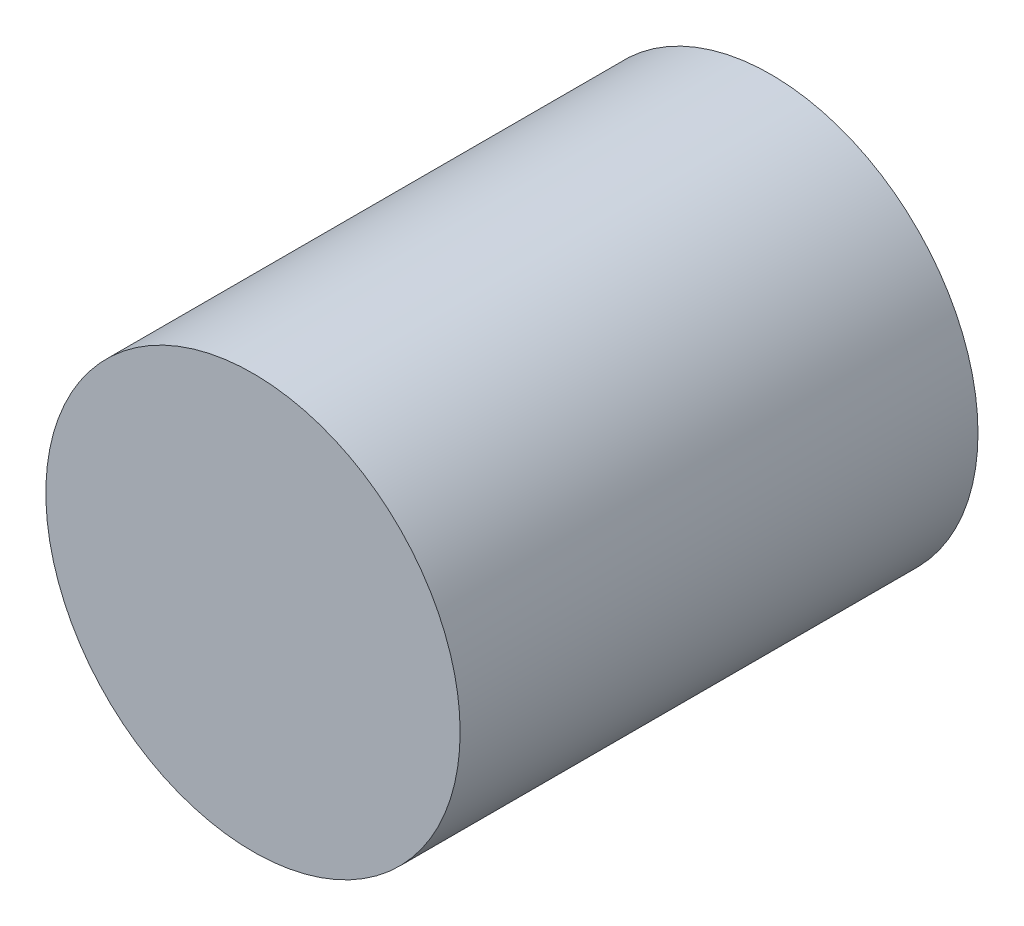
ISO-10303-21;
HEADER;
FILE_DESCRIPTION(('STEP AP214'),'2;1');
FILE_NAME('part.step','',(''),(''),'','','');
FILE_SCHEMA(('AUTOMOTIVE_DESIGN { 1 0 10303 214 1 1 1 1 }'));
ENDSEC;
DATA;
#1=APPLICATION_CONTEXT('core data for automotive mechanical design processes');
#2=APPLICATION_PROTOCOL_DEFINITION('international standard','automotive_design',2000,#1);
#3=PRODUCT_CONTEXT('',#1,'mechanical');
#4=PRODUCT('Part','Part','',(#3));
#5=PRODUCT_RELATED_PRODUCT_CATEGORY('part','',(#4));
#6=PRODUCT_DEFINITION_FORMATION('','',#4);
#7=PRODUCT_DEFINITION_CONTEXT('part definition',#1,'design');
#8=PRODUCT_DEFINITION('design','',#6,#7);
#9=PRODUCT_DEFINITION_SHAPE('','',#8);
#10=(LENGTH_UNIT() NAMED_UNIT(*) SI_UNIT(.MILLI.,.METRE.));
#11=(NAMED_UNIT(*) PLANE_ANGLE_UNIT() SI_UNIT($,.RADIAN.));
#12=(NAMED_UNIT(*) SI_UNIT($,.STERADIAN.) SOLID_ANGLE_UNIT());
#13=UNCERTAINTY_MEASURE_WITH_UNIT(LENGTH_MEASURE(1.E-05),#10,'distance_accuracy_value','');
#14=(GEOMETRIC_REPRESENTATION_CONTEXT(3) GLOBAL_UNCERTAINTY_ASSIGNED_CONTEXT((#13)) GLOBAL_UNIT_ASSIGNED_CONTEXT((#10,
#11,#12)) REPRESENTATION_CONTEXT('',''));
#15=CARTESIAN_POINT('',(0.,0.,0.));
#16=DIRECTION('',(0.,0.,1.));
#17=DIRECTION('',(1.,0.,0.));
#18=AXIS2_PLACEMENT_3D('',#15,#16,#17);
#19=CARTESIAN_POINT('',(0.,0.,12.5));
#20=DIRECTION('',(0.,0.,-1.));
#21=DIRECTION('',(-1.,0.,0.));
#22=AXIS2_PLACEMENT_3D('',#19,#20,#21);
#23=CYLINDRICAL_SURFACE('',#22,10.);
#24=CARTESIAN_POINT('',(0.,0.,12.5));
#25=DIRECTION('',(0.,0.,1.));
#26=DIRECTION('',(1.,0.,0.));
#27=AXIS2_PLACEMENT_3D('',#24,#25,#26);
#28=CIRCLE('',#27,10.);
#29=CARTESIAN_POINT('',(10.,0.,12.5));
#30=VERTEX_POINT('',#29);
#31=EDGE_CURVE('E10',#30,#30,#28,.T.);
#32=ORIENTED_EDGE('',*,*,#31,.F.);
#33=EDGE_LOOP('',(#32));
#34=FACE_BOUND('',#33,.T.);
#35=CARTESIAN_POINT('',(0.,0.,-12.5));
#36=DIRECTION('',(0.,0.,1.));
#37=DIRECTION('',(1.,0.,0.));
#38=AXIS2_PLACEMENT_3D('',#35,#36,#37);
#39=CIRCLE('',#38,10.);
#40=CARTESIAN_POINT('',(10.,0.,-12.5));
#41=VERTEX_POINT('',#40);
#42=EDGE_CURVE('E44',#41,#41,#39,.T.);
#43=ORIENTED_EDGE('',*,*,#42,.T.);
#44=EDGE_LOOP('',(#43));
#45=FACE_BOUND('',#44,.T.);
#46=ADVANCED_FACE('F41',(#34,#45),#23,.T.);
#47=CARTESIAN_POINT('',(0.,0.,12.5));
#48=DIRECTION('',(0.,0.,1.));
#49=DIRECTION('',(1.,0.,0.));
#50=AXIS2_PLACEMENT_3D('',#47,#48,#49);
#51=PLANE('',#50);
#52=ORIENTED_EDGE('',*,*,#31,.T.);
#53=EDGE_LOOP('',(#52));
#54=FACE_BOUND('',#53,.T.);
#55=ADVANCED_FACE('F58',(#54),#51,.T.);
#56=CARTESIAN_POINT('',(0.,0.,-12.5));
#57=DIRECTION('',(0.,0.,1.));
#58=DIRECTION('',(1.,0.,0.));
#59=AXIS2_PLACEMENT_3D('',#56,#57,#58);
#60=PLANE('',#59);
#61=ORIENTED_EDGE('',*,*,#42,.F.);
#62=EDGE_LOOP('',(#61));
#63=FACE_BOUND('',#62,.T.);
#64=ADVANCED_FACE('F56',(#63),#60,.F.);
#65=CLOSED_SHELL('',(#46,#55,#64));
#66=MANIFOLD_SOLID_BREP('B2',#65);
#67=ADVANCED_BREP_SHAPE_REPRESENTATION('',(#18,#66),#14);
#68=SHAPE_DEFINITION_REPRESENTATION(#9,#67);
ENDSEC;
END-ISO-10303-21;
